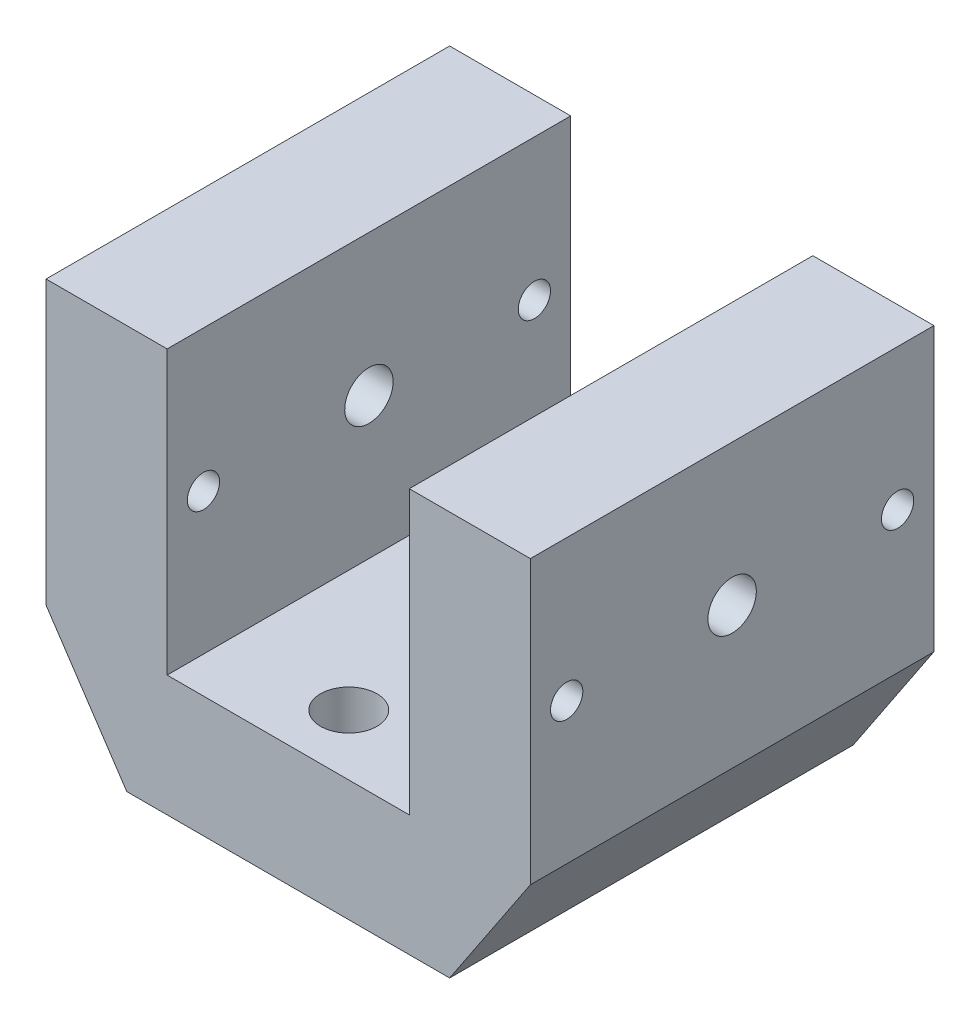
ISO-10303-21;
HEADER;
FILE_DESCRIPTION(('STEP AP214'),'2;1');
FILE_NAME('part.step','',(''),(''),'','','');
FILE_SCHEMA(('AUTOMOTIVE_DESIGN { 1 0 10303 214 1 1 1 1 }'));
ENDSEC;
DATA;
#1=APPLICATION_CONTEXT('core data for automotive mechanical design processes');
#2=APPLICATION_PROTOCOL_DEFINITION('international standard','automotive_design',2000,#1);
#3=PRODUCT_CONTEXT('',#1,'mechanical');
#4=PRODUCT('Part','Part','',(#3));
#5=PRODUCT_RELATED_PRODUCT_CATEGORY('part','',(#4));
#6=PRODUCT_DEFINITION_FORMATION('','',#4);
#7=PRODUCT_DEFINITION_CONTEXT('part definition',#1,'design');
#8=PRODUCT_DEFINITION('design','',#6,#7);
#9=PRODUCT_DEFINITION_SHAPE('','',#8);
#10=(LENGTH_UNIT() NAMED_UNIT(*) SI_UNIT(.MILLI.,.METRE.));
#11=(NAMED_UNIT(*) PLANE_ANGLE_UNIT() SI_UNIT($,.RADIAN.));
#12=(NAMED_UNIT(*) SI_UNIT($,.STERADIAN.) SOLID_ANGLE_UNIT());
#13=UNCERTAINTY_MEASURE_WITH_UNIT(LENGTH_MEASURE(1.E-05),#10,'distance_accuracy_value','');
#14=(GEOMETRIC_REPRESENTATION_CONTEXT(3) GLOBAL_UNCERTAINTY_ASSIGNED_CONTEXT((#13)) GLOBAL_UNIT_ASSIGNED_CONTEXT((#10,
#11,#12)) REPRESENTATION_CONTEXT('',''));
#15=CARTESIAN_POINT('',(0.,0.,0.));
#16=DIRECTION('',(0.,0.,1.));
#17=DIRECTION('',(1.,0.,0.));
#18=AXIS2_PLACEMENT_3D('',#15,#16,#17);
#19=CARTESIAN_POINT('',(0.,-50.,15.));
#20=DIRECTION('',(0.,1.,0.));
#21=DIRECTION('',(0.,0.,1.));
#22=AXIS2_PLACEMENT_3D('',#19,#20,#21);
#23=CYLINDRICAL_SURFACE('',#22,4.);
#24=CARTESIAN_POINT('',(0.,-50.,15.));
#25=DIRECTION('',(0.,1.,0.));
#26=DIRECTION('',(0.,0.,1.));
#27=AXIS2_PLACEMENT_3D('',#24,#25,#26);
#28=CIRCLE('',#27,4.);
#29=CARTESIAN_POINT('',(0.,-50.,19.));
#30=VERTEX_POINT('',#29);
#31=EDGE_CURVE('E274',#30,#30,#28,.T.);
#32=ORIENTED_EDGE('',*,*,#31,.F.);
#33=EDGE_LOOP('',(#32));
#34=FACE_BOUND('',#33,.T.);
#35=CARTESIAN_POINT('',(0.,-30.,15.));
#36=DIRECTION('',(0.,1.,0.));
#37=DIRECTION('',(-1.,0.,0.));
#38=AXIS2_PLACEMENT_3D('',#35,#36,#37);
#39=CIRCLE('',#38,4.);
#40=CARTESIAN_POINT('',(-4.,-30.,15.));
#41=VERTEX_POINT('',#40);
#42=EDGE_CURVE('E49',#41,#41,#39,.F.);
#43=ORIENTED_EDGE('',*,*,#42,.F.);
#44=EDGE_LOOP('',(#43));
#45=FACE_BOUND('',#44,.T.);
#46=ADVANCED_FACE('F45',(#34,#45),#23,.F.);
#47=CARTESIAN_POINT('',(0.,-50.,85.));
#48=DIRECTION('',(0.,1.,0.));
#49=DIRECTION('',(0.,0.,1.));
#50=AXIS2_PLACEMENT_3D('',#47,#48,#49);
#51=CYLINDRICAL_SURFACE('',#50,4.);
#52=CARTESIAN_POINT('',(0.,-50.,85.));
#53=DIRECTION('',(0.,1.,0.));
#54=DIRECTION('',(0.,0.,1.));
#55=AXIS2_PLACEMENT_3D('',#52,#53,#54);
#56=CIRCLE('',#55,4.);
#57=CARTESIAN_POINT('',(0.,-50.,89.));
#58=VERTEX_POINT('',#57);
#59=EDGE_CURVE('E275',#58,#58,#56,.T.);
#60=ORIENTED_EDGE('',*,*,#59,.F.);
#61=EDGE_LOOP('',(#60));
#62=FACE_BOUND('',#61,.T.);
#63=CARTESIAN_POINT('',(0.,-30.,85.));
#64=DIRECTION('',(0.,1.,0.));
#65=DIRECTION('',(-1.,0.,0.));
#66=AXIS2_PLACEMENT_3D('',#63,#64,#65);
#67=CIRCLE('',#66,4.);
#68=CARTESIAN_POINT('',(-3.99999999999999,-30.,85.));
#69=VERTEX_POINT('',#68);
#70=EDGE_CURVE('E213',#69,#69,#67,.F.);
#71=ORIENTED_EDGE('',*,*,#70,.F.);
#72=EDGE_LOOP('',(#71));
#73=FACE_BOUND('',#72,.T.);
#74=ADVANCED_FACE('F345',(#62,#73),#51,.F.);
#75=CARTESIAN_POINT('',(-60.,-50.,100.));
#76=DIRECTION('',(0.,1.,0.));
#77=DIRECTION('',(-1.,0.,0.));
#78=AXIS2_PLACEMENT_3D('',#75,#76,#77);
#79=PLANE('',#78);
#80=ORIENTED_EDGE('',*,*,#59,.T.);
#81=EDGE_LOOP('',(#80));
#82=FACE_BOUND('',#81,.T.);
#83=ORIENTED_EDGE('',*,*,#31,.T.);
#84=EDGE_LOOP('',(#83));
#85=FACE_BOUND('',#84,.T.);
#86=DIRECTION('',(0.,0.,-1.));
#87=VECTOR('',#86,1.);
#88=CARTESIAN_POINT('',(-40.,-50.,100.));
#89=LINE('',#88,#87);
#90=CARTESIAN_POINT('',(-40.,-50.,100.));
#91=VERTEX_POINT('',#90);
#92=CARTESIAN_POINT('',(-40.,-50.,0.));
#93=VERTEX_POINT('',#92);
#94=EDGE_CURVE('E122',#91,#93,#89,.T.);
#95=ORIENTED_EDGE('',*,*,#94,.T.);
#96=DIRECTION('',(1.,0.,0.));
#97=VECTOR('',#96,1.);
#98=CARTESIAN_POINT('',(-60.,-50.,0.));
#99=LINE('',#98,#97);
#100=CARTESIAN_POINT('',(40.,-50.,0.));
#101=VERTEX_POINT('',#100);
#102=EDGE_CURVE('E131',#93,#101,#99,.T.);
#103=ORIENTED_EDGE('',*,*,#102,.T.);
#104=DIRECTION('',(0.,0.,-1.));
#105=VECTOR('',#104,1.);
#106=CARTESIAN_POINT('',(40.,-50.,100.));
#107=LINE('',#106,#105);
#108=CARTESIAN_POINT('',(40.,-50.,100.));
#109=VERTEX_POINT('',#108);
#110=EDGE_CURVE('E145',#109,#101,#107,.T.);
#111=ORIENTED_EDGE('',*,*,#110,.F.);
#112=DIRECTION('',(1.,0.,0.));
#113=VECTOR('',#112,1.);
#114=CARTESIAN_POINT('',(-60.,-50.,100.));
#115=LINE('',#114,#113);
#116=EDGE_CURVE('E138',#91,#109,#115,.T.);
#117=ORIENTED_EDGE('',*,*,#116,.F.);
#118=EDGE_LOOP('',(#95,#103,#111,#117));
#119=FACE_BOUND('',#118,.T.);
#120=ADVANCED_FACE('F47',(#82,#85,#119),#79,.F.);
#121=CARTESIAN_POINT('',(60.,-50.,100.));
#122=DIRECTION('',(-1.,0.,0.));
#123=DIRECTION('',(0.,0.,1.));
#124=AXIS2_PLACEMENT_3D('',#121,#122,#123);
#125=PLANE('',#124);
#126=CARTESIAN_POINT('',(60.,15.,50.));
#127=DIRECTION('',(1.,0.,0.));
#128=DIRECTION('',(0.,0.,-1.));
#129=AXIS2_PLACEMENT_3D('',#126,#127,#128);
#130=CIRCLE('',#129,6.);
#131=CARTESIAN_POINT('',(60.,15.,44.));
#132=VERTEX_POINT('',#131);
#133=EDGE_CURVE('E224',#132,#132,#130,.T.);
#134=ORIENTED_EDGE('',*,*,#133,.F.);
#135=EDGE_LOOP('',(#134));
#136=FACE_BOUND('',#135,.T.);
#137=CARTESIAN_POINT('',(60.,15.,91.));
#138=DIRECTION('',(1.,0.,0.));
#139=DIRECTION('',(0.,0.,-1.));
#140=AXIS2_PLACEMENT_3D('',#137,#138,#139);
#141=CIRCLE('',#140,4.00000000000001);
#142=CARTESIAN_POINT('',(60.,15.,87.));
#143=VERTEX_POINT('',#142);
#144=EDGE_CURVE('E254',#143,#143,#141,.T.);
#145=ORIENTED_EDGE('',*,*,#144,.F.);
#146=EDGE_LOOP('',(#145));
#147=FACE_BOUND('',#146,.T.);
#148=CARTESIAN_POINT('',(60.,15.,9.));
#149=DIRECTION('',(1.,0.,0.));
#150=DIRECTION('',(0.,0.,-1.));
#151=AXIS2_PLACEMENT_3D('',#148,#149,#150);
#152=CIRCLE('',#151,4.);
#153=CARTESIAN_POINT('',(60.,15.,5.));
#154=VERTEX_POINT('',#153);
#155=EDGE_CURVE('E253',#154,#154,#152,.T.);
#156=ORIENTED_EDGE('',*,*,#155,.F.);
#157=EDGE_LOOP('',(#156));
#158=FACE_BOUND('',#157,.T.);
#159=DIRECTION('',(0.,0.,-1.));
#160=VECTOR('',#159,1.);
#161=CARTESIAN_POINT('',(60.,-20.,100.));
#162=LINE('',#161,#160);
#163=CARTESIAN_POINT('',(60.,-20.,100.));
#164=VERTEX_POINT('',#163);
#165=CARTESIAN_POINT('',(60.,-20.,0.));
#166=VERTEX_POINT('',#165);
#167=EDGE_CURVE('E160',#164,#166,#162,.T.);
#168=ORIENTED_EDGE('',*,*,#167,.T.);
#169=DIRECTION('',(0.,1.,0.));
#170=VECTOR('',#169,1.);
#171=CARTESIAN_POINT('',(60.,-50.,0.));
#172=LINE('',#171,#170);
#173=CARTESIAN_POINT('',(60.,50.,0.));
#174=VERTEX_POINT('',#173);
#175=EDGE_CURVE('E172',#166,#174,#172,.T.);
#176=ORIENTED_EDGE('',*,*,#175,.T.);
#177=DIRECTION('',(0.,0.,-1.));
#178=VECTOR('',#177,1.);
#179=CARTESIAN_POINT('',(60.,50.,100.));
#180=LINE('',#179,#178);
#181=CARTESIAN_POINT('',(60.,50.,100.));
#182=VERTEX_POINT('',#181);
#183=EDGE_CURVE('E182',#182,#174,#180,.T.);
#184=ORIENTED_EDGE('',*,*,#183,.F.);
#185=DIRECTION('',(0.,1.,0.));
#186=VECTOR('',#185,1.);
#187=CARTESIAN_POINT('',(60.,-50.,100.));
#188=LINE('',#187,#186);
#189=EDGE_CURVE('E147',#164,#182,#188,.T.);
#190=ORIENTED_EDGE('',*,*,#189,.F.);
#191=EDGE_LOOP('',(#168,#176,#184,#190));
#192=FACE_BOUND('',#191,.T.);
#193=ADVANCED_FACE('F320',(#136,#147,#158,#192),#125,.F.);
#194=CARTESIAN_POINT('',(-60.,50.,100.));
#195=DIRECTION('',(0.,-1.,0.));
#196=DIRECTION('',(1.,0.,0.));
#197=AXIS2_PLACEMENT_3D('',#194,#195,#196);
#198=PLANE('',#197);
#199=DIRECTION('',(0.,0.,-1.));
#200=VECTOR('',#199,1.);
#201=CARTESIAN_POINT('',(-30.,50.,100.));
#202=LINE('',#201,#200);
#203=CARTESIAN_POINT('',(-30.,50.,100.));
#204=VERTEX_POINT('',#203);
#205=CARTESIAN_POINT('',(-30.,50.,0.));
#206=VERTEX_POINT('',#205);
#207=EDGE_CURVE('E142',#204,#206,#202,.T.);
#208=ORIENTED_EDGE('',*,*,#207,.T.);
#209=DIRECTION('',(-1.,0.,0.));
#210=VECTOR('',#209,1.);
#211=CARTESIAN_POINT('',(-60.,50.,0.));
#212=LINE('',#211,#210);
#213=CARTESIAN_POINT('',(-60.,50.,0.));
#214=VERTEX_POINT('',#213);
#215=EDGE_CURVE('E175',#206,#214,#212,.T.);
#216=ORIENTED_EDGE('',*,*,#215,.T.);
#217=DIRECTION('',(0.,0.,-1.));
#218=VECTOR('',#217,1.);
#219=CARTESIAN_POINT('',(-60.,50.,100.));
#220=LINE('',#219,#218);
#221=CARTESIAN_POINT('',(-60.,50.,100.));
#222=VERTEX_POINT('',#221);
#223=EDGE_CURVE('E169',#222,#214,#220,.T.);
#224=ORIENTED_EDGE('',*,*,#223,.F.);
#225=DIRECTION('',(-1.,0.,0.));
#226=VECTOR('',#225,1.);
#227=CARTESIAN_POINT('',(-60.,50.,100.));
#228=LINE('',#227,#226);
#229=EDGE_CURVE('E154',#204,#222,#228,.T.);
#230=ORIENTED_EDGE('',*,*,#229,.F.);
#231=EDGE_LOOP('',(#208,#216,#224,#230));
#232=FACE_BOUND('',#231,.T.);
#233=ADVANCED_FACE('F474',(#232),#198,.F.);
#234=DIRECTION('',(0.,0.,-1.));
#235=VECTOR('',#234,1.);
#236=CARTESIAN_POINT('',(30.,50.,100.));
#237=LINE('',#236,#235);
#238=CARTESIAN_POINT('',(30.,50.,100.));
#239=VERTEX_POINT('',#238);
#240=CARTESIAN_POINT('',(30.,50.,0.));
#241=VERTEX_POINT('',#240);
#242=EDGE_CURVE('E63',#239,#241,#237,.T.);
#243=ORIENTED_EDGE('',*,*,#242,.F.);
#244=EDGE_CURVE('E163',#182,#239,#228,.T.);
#245=ORIENTED_EDGE('',*,*,#244,.F.);
#246=ORIENTED_EDGE('',*,*,#183,.T.);
#247=EDGE_CURVE('E157',#174,#241,#212,.T.);
#248=ORIENTED_EDGE('',*,*,#247,.T.);
#249=EDGE_LOOP('',(#243,#245,#246,#248));
#250=FACE_BOUND('',#249,.T.);
#251=ADVANCED_FACE('F327',(#250),#198,.F.);
#252=CARTESIAN_POINT('',(-60.,-50.,100.));
#253=DIRECTION('',(1.,0.,0.));
#254=DIRECTION('',(0.,0.,-1.));
#255=AXIS2_PLACEMENT_3D('',#252,#253,#254);
#256=PLANE('',#255);
#257=CARTESIAN_POINT('',(-60.,15.,50.));
#258=DIRECTION('',(1.,0.,0.));
#259=DIRECTION('',(0.,0.,-1.));
#260=AXIS2_PLACEMENT_3D('',#257,#258,#259);
#261=CIRCLE('',#260,6.);
#262=CARTESIAN_POINT('',(-60.,15.,44.));
#263=VERTEX_POINT('',#262);
#264=EDGE_CURVE('E212',#263,#263,#261,.T.);
#265=ORIENTED_EDGE('',*,*,#264,.T.);
#266=EDGE_LOOP('',(#265));
#267=FACE_BOUND('',#266,.T.);
#268=CARTESIAN_POINT('',(-60.,15.,91.));
#269=DIRECTION('',(1.,0.,0.));
#270=DIRECTION('',(0.,0.,-1.));
#271=AXIS2_PLACEMENT_3D('',#268,#269,#270);
#272=CIRCLE('',#271,4.00000000000001);
#273=CARTESIAN_POINT('',(-60.,15.,87.));
#274=VERTEX_POINT('',#273);
#275=EDGE_CURVE('E202',#274,#274,#272,.T.);
#276=ORIENTED_EDGE('',*,*,#275,.T.);
#277=EDGE_LOOP('',(#276));
#278=FACE_BOUND('',#277,.T.);
#279=CARTESIAN_POINT('',(-60.,15.,9.));
#280=DIRECTION('',(1.,0.,0.));
#281=DIRECTION('',(0.,0.,-1.));
#282=AXIS2_PLACEMENT_3D('',#279,#280,#281);
#283=CIRCLE('',#282,4.);
#284=CARTESIAN_POINT('',(-60.,15.,5.));
#285=VERTEX_POINT('',#284);
#286=EDGE_CURVE('E258',#285,#285,#283,.T.);
#287=ORIENTED_EDGE('',*,*,#286,.T.);
#288=EDGE_LOOP('',(#287));
#289=FACE_BOUND('',#288,.T.);
#290=DIRECTION('',(0.,0.,-1.));
#291=VECTOR('',#290,1.);
#292=CARTESIAN_POINT('',(-60.,-20.,100.));
#293=LINE('',#292,#291);
#294=CARTESIAN_POINT('',(-60.,-20.,100.));
#295=VERTEX_POINT('',#294);
#296=CARTESIAN_POINT('',(-60.,-20.,0.));
#297=VERTEX_POINT('',#296);
#298=EDGE_CURVE('E70',#295,#297,#293,.T.);
#299=ORIENTED_EDGE('',*,*,#298,.F.);
#300=DIRECTION('',(0.,-1.,0.));
#301=VECTOR('',#300,1.);
#302=CARTESIAN_POINT('',(-60.,-50.,100.));
#303=LINE('',#302,#301);
#304=EDGE_CURVE('E140',#222,#295,#303,.T.);
#305=ORIENTED_EDGE('',*,*,#304,.F.);
#306=ORIENTED_EDGE('',*,*,#223,.T.);
#307=DIRECTION('',(0.,-1.,0.));
#308=VECTOR('',#307,1.);
#309=CARTESIAN_POINT('',(-60.,-50.,0.));
#310=LINE('',#309,#308);
#311=EDGE_CURVE('E148',#214,#297,#310,.T.);
#312=ORIENTED_EDGE('',*,*,#311,.T.);
#313=EDGE_LOOP('',(#299,#305,#306,#312));
#314=FACE_BOUND('',#313,.T.);
#315=ADVANCED_FACE('F476',(#267,#278,#289,#314),#256,.F.);
#316=CARTESIAN_POINT('',(0.,0.,100.));
#317=DIRECTION('',(0.,0.,1.));
#318=DIRECTION('',(1.,0.,0.));
#319=AXIS2_PLACEMENT_3D('',#316,#317,#318);
#320=PLANE('',#319);
#321=ORIENTED_EDGE('',*,*,#304,.T.);
#322=DIRECTION('',(-0.554700196225229,0.832050294337843,0.));
#323=VECTOR('',#322,1.);
#324=CARTESIAN_POINT('',(-60.,-20.,100.));
#325=LINE('',#324,#323);
#326=EDGE_CURVE('E125',#91,#295,#325,.T.);
#327=ORIENTED_EDGE('',*,*,#326,.F.);
#328=ORIENTED_EDGE('',*,*,#116,.T.);
#329=DIRECTION('',(-0.554700196225229,-0.832050294337844,0.));
#330=VECTOR('',#329,1.);
#331=CARTESIAN_POINT('',(60.,-20.,100.));
#332=LINE('',#331,#330);
#333=EDGE_CURVE('E279',#164,#109,#332,.T.);
#334=ORIENTED_EDGE('',*,*,#333,.F.);
#335=ORIENTED_EDGE('',*,*,#189,.T.);
#336=ORIENTED_EDGE('',*,*,#244,.T.);
#337=DIRECTION('',(0.,1.,0.));
#338=VECTOR('',#337,1.);
#339=CARTESIAN_POINT('',(30.,50.,100.));
#340=LINE('',#339,#338);
#341=CARTESIAN_POINT('',(30.,-20.,100.));
#342=VERTEX_POINT('',#341);
#343=EDGE_CURVE('E291',#342,#239,#340,.T.);
#344=ORIENTED_EDGE('',*,*,#343,.F.);
#345=DIRECTION('',(1.,0.,0.));
#346=VECTOR('',#345,1.);
#347=CARTESIAN_POINT('',(-30.,-20.,100.));
#348=LINE('',#347,#346);
#349=CARTESIAN_POINT('',(-30.,-20.,100.));
#350=VERTEX_POINT('',#349);
#351=EDGE_CURVE('E288',#350,#342,#348,.T.);
#352=ORIENTED_EDGE('',*,*,#351,.F.);
#353=DIRECTION('',(0.,-1.,0.));
#354=VECTOR('',#353,1.);
#355=CARTESIAN_POINT('',(-30.,50.,100.));
#356=LINE('',#355,#354);
#357=EDGE_CURVE('E285',#204,#350,#356,.T.);
#358=ORIENTED_EDGE('',*,*,#357,.F.);
#359=ORIENTED_EDGE('',*,*,#229,.T.);
#360=EDGE_LOOP('',(#321,#327,#328,#334,#335,#336,#344,#352,#358,#359));
#361=FACE_BOUND('',#360,.T.);
#362=ADVANCED_FACE('F136',(#361),#320,.T.);
#363=CARTESIAN_POINT('',(0.,0.,0.));
#364=DIRECTION('',(0.,0.,1.));
#365=DIRECTION('',(1.,0.,0.));
#366=AXIS2_PLACEMENT_3D('',#363,#364,#365);
#367=PLANE('',#366);
#368=DIRECTION('',(0.554700196225229,-0.832050294337844,0.));
#369=VECTOR('',#368,1.);
#370=CARTESIAN_POINT('',(-50.7692307692308,-33.8461538461539,0.));
#371=LINE('',#370,#369);
#372=EDGE_CURVE('E11',#297,#93,#371,.T.);
#373=ORIENTED_EDGE('',*,*,#372,.F.);
#374=ORIENTED_EDGE('',*,*,#311,.F.);
#375=ORIENTED_EDGE('',*,*,#215,.F.);
#376=DIRECTION('',(0.,1.,0.));
#377=VECTOR('',#376,1.);
#378=CARTESIAN_POINT('',(-30.,0.,0.));
#379=LINE('',#378,#377);
#380=CARTESIAN_POINT('',(-30.,-20.,0.));
#381=VERTEX_POINT('',#380);
#382=EDGE_CURVE('E55',#381,#206,#379,.T.);
#383=ORIENTED_EDGE('',*,*,#382,.F.);
#384=DIRECTION('',(-1.,0.,0.));
#385=VECTOR('',#384,1.);
#386=CARTESIAN_POINT('',(0.,-20.,0.));
#387=LINE('',#386,#385);
#388=CARTESIAN_POINT('',(30.,-20.,0.));
#389=VERTEX_POINT('',#388);
#390=EDGE_CURVE('E192',#389,#381,#387,.T.);
#391=ORIENTED_EDGE('',*,*,#390,.F.);
#392=DIRECTION('',(0.,-1.,0.));
#393=VECTOR('',#392,1.);
#394=CARTESIAN_POINT('',(30.,0.,0.));
#395=LINE('',#394,#393);
#396=EDGE_CURVE('E189',#241,#389,#395,.T.);
#397=ORIENTED_EDGE('',*,*,#396,.F.);
#398=ORIENTED_EDGE('',*,*,#247,.F.);
#399=ORIENTED_EDGE('',*,*,#175,.F.);
#400=DIRECTION('',(0.554700196225229,0.832050294337844,0.));
#401=VECTOR('',#400,1.);
#402=CARTESIAN_POINT('',(50.7692307692308,-33.8461538461539,0.));
#403=LINE('',#402,#401);
#404=EDGE_CURVE('E186',#101,#166,#403,.T.);
#405=ORIENTED_EDGE('',*,*,#404,.F.);
#406=ORIENTED_EDGE('',*,*,#102,.F.);
#407=EDGE_LOOP('',(#373,#374,#375,#383,#391,#397,#398,#399,#405,#406));
#408=FACE_BOUND('',#407,.T.);
#409=ADVANCED_FACE('F324',(#408),#367,.F.);
#410=CARTESIAN_POINT('',(60.,-20.,100.));
#411=DIRECTION('',(0.832050294337844,-0.554700196225229,0.));
#412=DIRECTION('',(0.554700196225229,0.832050294337844,0.));
#413=AXIS2_PLACEMENT_3D('',#410,#411,#412);
#414=PLANE('',#413);
#415=ORIENTED_EDGE('',*,*,#404,.T.);
#416=ORIENTED_EDGE('',*,*,#167,.F.);
#417=ORIENTED_EDGE('',*,*,#333,.T.);
#418=ORIENTED_EDGE('',*,*,#110,.T.);
#419=EDGE_LOOP('',(#415,#416,#417,#418));
#420=FACE_BOUND('',#419,.T.);
#421=ADVANCED_FACE('F331',(#420),#414,.T.);
#422=CARTESIAN_POINT('',(-30.,50.,100.));
#423=DIRECTION('',(1.,0.,0.));
#424=DIRECTION('',(0.,1.,0.));
#425=AXIS2_PLACEMENT_3D('',#422,#423,#424);
#426=PLANE('',#425);
#427=CARTESIAN_POINT('',(-30.,15.,50.));
#428=DIRECTION('',(1.,0.,0.));
#429=DIRECTION('',(0.,1.,0.));
#430=AXIS2_PLACEMENT_3D('',#427,#428,#429);
#431=CIRCLE('',#430,6.);
#432=CARTESIAN_POINT('',(-30.,21.,50.));
#433=VERTEX_POINT('',#432);
#434=EDGE_CURVE('E211',#433,#433,#431,.T.);
#435=ORIENTED_EDGE('',*,*,#434,.F.);
#436=EDGE_LOOP('',(#435));
#437=FACE_BOUND('',#436,.T.);
#438=CARTESIAN_POINT('',(-30.,15.,91.));
#439=DIRECTION('',(1.,0.,0.));
#440=DIRECTION('',(0.,1.,0.));
#441=AXIS2_PLACEMENT_3D('',#438,#439,#440);
#442=CIRCLE('',#441,4.00000000000001);
#443=CARTESIAN_POINT('',(-30.,19.,91.));
#444=VERTEX_POINT('',#443);
#445=EDGE_CURVE('E207',#444,#444,#442,.T.);
#446=ORIENTED_EDGE('',*,*,#445,.F.);
#447=EDGE_LOOP('',(#446));
#448=FACE_BOUND('',#447,.T.);
#449=CARTESIAN_POINT('',(-30.,15.,9.));
#450=DIRECTION('',(1.,0.,0.));
#451=DIRECTION('',(0.,1.,0.));
#452=AXIS2_PLACEMENT_3D('',#449,#450,#451);
#453=CIRCLE('',#452,4.);
#454=CARTESIAN_POINT('',(-30.,19.,9.));
#455=VERTEX_POINT('',#454);
#456=EDGE_CURVE('E201',#455,#455,#453,.T.);
#457=ORIENTED_EDGE('',*,*,#456,.F.);
#458=EDGE_LOOP('',(#457));
#459=FACE_BOUND('',#458,.T.);
#460=ORIENTED_EDGE('',*,*,#382,.T.);
#461=ORIENTED_EDGE('',*,*,#207,.F.);
#462=ORIENTED_EDGE('',*,*,#357,.T.);
#463=DIRECTION('',(0.,0.,-1.));
#464=VECTOR('',#463,1.);
#465=CARTESIAN_POINT('',(-30.,-20.,100.));
#466=LINE('',#465,#464);
#467=EDGE_CURVE('E300',#350,#381,#466,.T.);
#468=ORIENTED_EDGE('',*,*,#467,.T.);
#469=EDGE_LOOP('',(#460,#461,#462,#468));
#470=FACE_BOUND('',#469,.T.);
#471=ADVANCED_FACE('F333',(#437,#448,#459,#470),#426,.T.);
#472=CARTESIAN_POINT('',(-30.,-20.,100.));
#473=DIRECTION('',(0.,1.,0.));
#474=DIRECTION('',(-1.,0.,0.));
#475=AXIS2_PLACEMENT_3D('',#472,#473,#474);
#476=PLANE('',#475);
#477=CARTESIAN_POINT('',(0.,-20.,85.));
#478=DIRECTION('',(0.,1.,0.));
#479=DIRECTION('',(-1.,0.,0.));
#480=AXIS2_PLACEMENT_3D('',#477,#478,#479);
#481=CIRCLE('',#480,7.);
#482=CARTESIAN_POINT('',(-6.99999999999999,-20.,85.));
#483=VERTEX_POINT('',#482);
#484=EDGE_CURVE('E226',#483,#483,#481,.T.);
#485=ORIENTED_EDGE('',*,*,#484,.F.);
#486=EDGE_LOOP('',(#485));
#487=FACE_BOUND('',#486,.T.);
#488=CARTESIAN_POINT('',(0.,-20.,15.));
#489=DIRECTION('',(0.,1.,0.));
#490=DIRECTION('',(-1.,0.,0.));
#491=AXIS2_PLACEMENT_3D('',#488,#489,#490);
#492=CIRCLE('',#491,7.);
#493=CARTESIAN_POINT('',(-7.,-20.,15.));
#494=VERTEX_POINT('',#493);
#495=EDGE_CURVE('E240',#494,#494,#492,.T.);
#496=ORIENTED_EDGE('',*,*,#495,.F.);
#497=EDGE_LOOP('',(#496));
#498=FACE_BOUND('',#497,.T.);
#499=ORIENTED_EDGE('',*,*,#390,.T.);
#500=ORIENTED_EDGE('',*,*,#467,.F.);
#501=ORIENTED_EDGE('',*,*,#351,.T.);
#502=DIRECTION('',(0.,0.,-1.));
#503=VECTOR('',#502,1.);
#504=CARTESIAN_POINT('',(30.,-20.,100.));
#505=LINE('',#504,#503);
#506=EDGE_CURVE('E296',#342,#389,#505,.T.);
#507=ORIENTED_EDGE('',*,*,#506,.T.);
#508=EDGE_LOOP('',(#499,#500,#501,#507));
#509=FACE_BOUND('',#508,.T.);
#510=ADVANCED_FACE('F339',(#487,#498,#509),#476,.T.);
#511=CARTESIAN_POINT('',(30.,50.,100.));
#512=DIRECTION('',(-1.,0.,0.));
#513=DIRECTION('',(0.,-1.,0.));
#514=AXIS2_PLACEMENT_3D('',#511,#512,#513);
#515=PLANE('',#514);
#516=CARTESIAN_POINT('',(30.,15.,50.));
#517=DIRECTION('',(-1.,0.,0.));
#518=DIRECTION('',(0.,-1.,0.));
#519=AXIS2_PLACEMENT_3D('',#516,#517,#518);
#520=CIRCLE('',#519,6.);
#521=CARTESIAN_POINT('',(30.,9.00000000000001,50.));
#522=VERTEX_POINT('',#521);
#523=EDGE_CURVE('E208',#522,#522,#520,.T.);
#524=ORIENTED_EDGE('',*,*,#523,.F.);
#525=EDGE_LOOP('',(#524));
#526=FACE_BOUND('',#525,.T.);
#527=CARTESIAN_POINT('',(30.,15.,91.));
#528=DIRECTION('',(-1.,0.,0.));
#529=DIRECTION('',(0.,-1.,0.));
#530=AXIS2_PLACEMENT_3D('',#527,#528,#529);
#531=CIRCLE('',#530,4.00000000000001);
#532=CARTESIAN_POINT('',(30.,11.,91.));
#533=VERTEX_POINT('',#532);
#534=EDGE_CURVE('E203',#533,#533,#531,.T.);
#535=ORIENTED_EDGE('',*,*,#534,.F.);
#536=EDGE_LOOP('',(#535));
#537=FACE_BOUND('',#536,.T.);
#538=CARTESIAN_POINT('',(30.,15.,9.));
#539=DIRECTION('',(-1.,0.,0.));
#540=DIRECTION('',(0.,-1.,0.));
#541=AXIS2_PLACEMENT_3D('',#538,#539,#540);
#542=CIRCLE('',#541,4.);
#543=CARTESIAN_POINT('',(30.,11.,9.));
#544=VERTEX_POINT('',#543);
#545=EDGE_CURVE('E197',#544,#544,#542,.T.);
#546=ORIENTED_EDGE('',*,*,#545,.F.);
#547=EDGE_LOOP('',(#546));
#548=FACE_BOUND('',#547,.T.);
#549=ORIENTED_EDGE('',*,*,#396,.T.);
#550=ORIENTED_EDGE('',*,*,#506,.F.);
#551=ORIENTED_EDGE('',*,*,#343,.T.);
#552=ORIENTED_EDGE('',*,*,#242,.T.);
#553=EDGE_LOOP('',(#549,#550,#551,#552));
#554=FACE_BOUND('',#553,.T.);
#555=ADVANCED_FACE('F360',(#526,#537,#548,#554),#515,.T.);
#556=CARTESIAN_POINT('',(-60.,-20.,100.));
#557=DIRECTION('',(-0.832050294337844,-0.554700196225229,0.));
#558=DIRECTION('',(0.554700196225229,-0.832050294337844,0.));
#559=AXIS2_PLACEMENT_3D('',#556,#557,#558);
#560=PLANE('',#559);
#561=ORIENTED_EDGE('',*,*,#372,.T.);
#562=ORIENTED_EDGE('',*,*,#94,.F.);
#563=ORIENTED_EDGE('',*,*,#326,.T.);
#564=ORIENTED_EDGE('',*,*,#298,.T.);
#565=EDGE_LOOP('',(#561,#562,#563,#564));
#566=FACE_BOUND('',#565,.T.);
#567=ADVANCED_FACE('F124',(#566),#560,.T.);
#568=CARTESIAN_POINT('',(-60.,15.,9.));
#569=DIRECTION('',(1.,0.,0.));
#570=DIRECTION('',(0.,0.,-1.));
#571=AXIS2_PLACEMENT_3D('',#568,#569,#570);
#572=CYLINDRICAL_SURFACE('',#571,4.);
#573=ORIENTED_EDGE('',*,*,#545,.T.);
#574=EDGE_LOOP('',(#573));
#575=FACE_BOUND('',#574,.T.);
#576=ORIENTED_EDGE('',*,*,#155,.T.);
#577=EDGE_LOOP('',(#576));
#578=FACE_BOUND('',#577,.T.);
#579=ADVANCED_FACE('F359',(#575,#578),#572,.F.);
#580=CARTESIAN_POINT('',(-60.,15.,91.));
#581=DIRECTION('',(1.,0.,0.));
#582=DIRECTION('',(0.,0.,-1.));
#583=AXIS2_PLACEMENT_3D('',#580,#581,#582);
#584=CYLINDRICAL_SURFACE('',#583,4.00000000000001);
#585=ORIENTED_EDGE('',*,*,#534,.T.);
#586=EDGE_LOOP('',(#585));
#587=FACE_BOUND('',#586,.T.);
#588=ORIENTED_EDGE('',*,*,#144,.T.);
#589=EDGE_LOOP('',(#588));
#590=FACE_BOUND('',#589,.T.);
#591=ADVANCED_FACE('F500',(#587,#590),#584,.F.);
#592=ORIENTED_EDGE('',*,*,#456,.T.);
#593=EDGE_LOOP('',(#592));
#594=FACE_BOUND('',#593,.T.);
#595=ORIENTED_EDGE('',*,*,#286,.F.);
#596=EDGE_LOOP('',(#595));
#597=FACE_BOUND('',#596,.T.);
#598=ADVANCED_FACE('F502',(#594,#597),#572,.F.);
#599=ORIENTED_EDGE('',*,*,#445,.T.);
#600=EDGE_LOOP('',(#599));
#601=FACE_BOUND('',#600,.T.);
#602=ORIENTED_EDGE('',*,*,#275,.F.);
#603=EDGE_LOOP('',(#602));
#604=FACE_BOUND('',#603,.T.);
#605=ADVANCED_FACE('F508',(#601,#604),#584,.F.);
#606=CARTESIAN_POINT('',(-60.,15.,50.));
#607=DIRECTION('',(1.,0.,0.));
#608=DIRECTION('',(0.,0.,-1.));
#609=AXIS2_PLACEMENT_3D('',#606,#607,#608);
#610=CYLINDRICAL_SURFACE('',#609,6.);
#611=ORIENTED_EDGE('',*,*,#523,.T.);
#612=EDGE_LOOP('',(#611));
#613=FACE_BOUND('',#612,.T.);
#614=ORIENTED_EDGE('',*,*,#133,.T.);
#615=EDGE_LOOP('',(#614));
#616=FACE_BOUND('',#615,.T.);
#617=ADVANCED_FACE('F514',(#613,#616),#610,.F.);
#618=ORIENTED_EDGE('',*,*,#434,.T.);
#619=EDGE_LOOP('',(#618));
#620=FACE_BOUND('',#619,.T.);
#621=ORIENTED_EDGE('',*,*,#264,.F.);
#622=EDGE_LOOP('',(#621));
#623=FACE_BOUND('',#622,.T.);
#624=ADVANCED_FACE('F524',(#620,#623),#610,.F.);
#625=CARTESIAN_POINT('',(0.,-30.,85.));
#626=DIRECTION('',(0.,1.,0.));
#627=DIRECTION('',(-1.,0.,0.));
#628=AXIS2_PLACEMENT_3D('',#625,#626,#627);
#629=PLANE('',#628);
#630=CARTESIAN_POINT('',(0.,-30.,85.));
#631=DIRECTION('',(0.,1.,0.));
#632=DIRECTION('',(-1.,0.,0.));
#633=AXIS2_PLACEMENT_3D('',#630,#631,#632);
#634=CIRCLE('',#633,7.);
#635=CARTESIAN_POINT('',(-6.99999999999999,-30.,85.));
#636=VERTEX_POINT('',#635);
#637=EDGE_CURVE('E216',#636,#636,#634,.T.);
#638=ORIENTED_EDGE('',*,*,#637,.T.);
#639=EDGE_LOOP('',(#638));
#640=FACE_BOUND('',#639,.T.);
#641=ORIENTED_EDGE('',*,*,#70,.T.);
#642=EDGE_LOOP('',(#641));
#643=FACE_BOUND('',#642,.T.);
#644=ADVANCED_FACE('F540',(#640,#643),#629,.T.);
#645=CARTESIAN_POINT('',(0.,-30.,85.));
#646=DIRECTION('',(0.,1.,0.));
#647=DIRECTION('',(0.,0.,1.));
#648=AXIS2_PLACEMENT_3D('',#645,#646,#647);
#649=CYLINDRICAL_SURFACE('',#648,7.);
#650=ORIENTED_EDGE('',*,*,#637,.F.);
#651=EDGE_LOOP('',(#650));
#652=FACE_BOUND('',#651,.T.);
#653=ORIENTED_EDGE('',*,*,#484,.T.);
#654=EDGE_LOOP('',(#653));
#655=FACE_BOUND('',#654,.T.);
#656=ADVANCED_FACE('F536',(#652,#655),#649,.F.);
#657=CARTESIAN_POINT('',(0.,-30.,15.));
#658=DIRECTION('',(0.,1.,0.));
#659=DIRECTION('',(-1.,0.,0.));
#660=AXIS2_PLACEMENT_3D('',#657,#658,#659);
#661=PLANE('',#660);
#662=CARTESIAN_POINT('',(0.,-30.,15.));
#663=DIRECTION('',(0.,1.,0.));
#664=DIRECTION('',(-1.,0.,0.));
#665=AXIS2_PLACEMENT_3D('',#662,#663,#664);
#666=CIRCLE('',#665,7.);
#667=CARTESIAN_POINT('',(-7.,-30.,15.));
#668=VERTEX_POINT('',#667);
#669=EDGE_CURVE('E234',#668,#668,#666,.T.);
#670=ORIENTED_EDGE('',*,*,#669,.T.);
#671=EDGE_LOOP('',(#670));
#672=FACE_BOUND('',#671,.T.);
#673=ORIENTED_EDGE('',*,*,#42,.T.);
#674=EDGE_LOOP('',(#673));
#675=FACE_BOUND('',#674,.T.);
#676=ADVANCED_FACE('F532',(#672,#675),#661,.T.);
#677=CARTESIAN_POINT('',(0.,-30.,15.));
#678=DIRECTION('',(0.,1.,0.));
#679=DIRECTION('',(0.,0.,1.));
#680=AXIS2_PLACEMENT_3D('',#677,#678,#679);
#681=CYLINDRICAL_SURFACE('',#680,7.);
#682=ORIENTED_EDGE('',*,*,#669,.F.);
#683=EDGE_LOOP('',(#682));
#684=FACE_BOUND('',#683,.T.);
#685=ORIENTED_EDGE('',*,*,#495,.T.);
#686=EDGE_LOOP('',(#685));
#687=FACE_BOUND('',#686,.T.);
#688=ADVANCED_FACE('F529',(#684,#687),#681,.F.);
#689=CLOSED_SHELL('',(#46,#74,#120,#193,#233,#251,#315,#362,#409,#421,#471,#510,#555,#567,#579,
#591,#598,#605,#617,#624,#644,#656,#676,#688));
#690=MANIFOLD_SOLID_BREP('B2',#689);
#691=ADVANCED_BREP_SHAPE_REPRESENTATION('',(#18,#690),#14);
#692=SHAPE_DEFINITION_REPRESENTATION(#9,#691);
ENDSEC;
END-ISO-10303-21;
